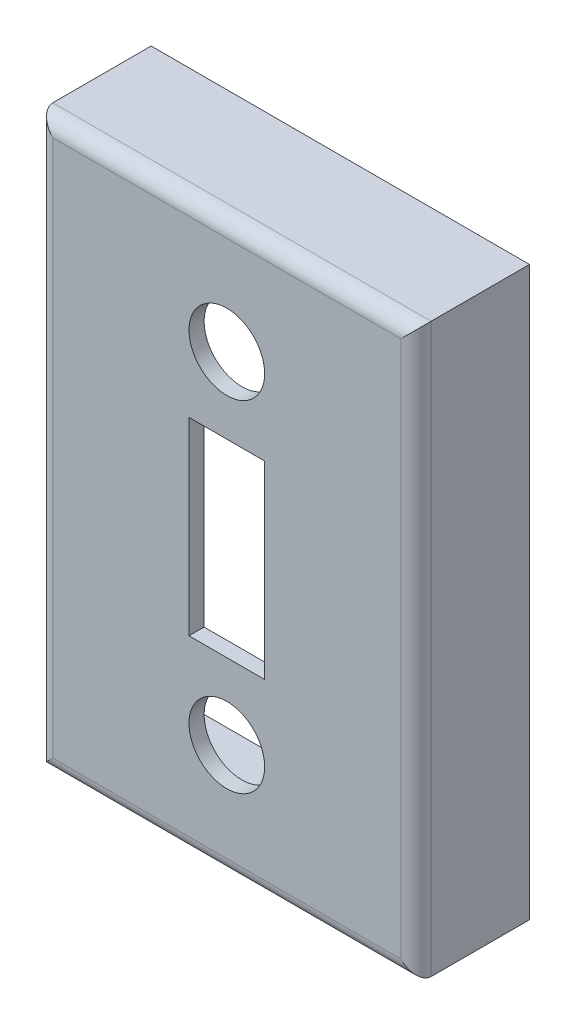
ISO-10303-21;
HEADER;
FILE_DESCRIPTION(('STEP AP214'),'2;1');
FILE_NAME('part.step','',(''),(''),'','','');
FILE_SCHEMA(('AUTOMOTIVE_DESIGN { 1 0 10303 214 1 1 1 1 }'));
ENDSEC;
DATA;
#1=APPLICATION_CONTEXT('core data for automotive mechanical design processes');
#2=APPLICATION_PROTOCOL_DEFINITION('international standard','automotive_design',2000,#1);
#3=PRODUCT_CONTEXT('',#1,'mechanical');
#4=PRODUCT('Part','Part','',(#3));
#5=PRODUCT_RELATED_PRODUCT_CATEGORY('part','',(#4));
#6=PRODUCT_DEFINITION_FORMATION('','',#4);
#7=PRODUCT_DEFINITION_CONTEXT('part definition',#1,'design');
#8=PRODUCT_DEFINITION('design','',#6,#7);
#9=PRODUCT_DEFINITION_SHAPE('','',#8);
#10=(LENGTH_UNIT() NAMED_UNIT(*) SI_UNIT(.MILLI.,.METRE.));
#11=(NAMED_UNIT(*) PLANE_ANGLE_UNIT() SI_UNIT($,.RADIAN.));
#12=(NAMED_UNIT(*) SI_UNIT($,.STERADIAN.) SOLID_ANGLE_UNIT());
#13=UNCERTAINTY_MEASURE_WITH_UNIT(LENGTH_MEASURE(1.E-05),#10,'distance_accuracy_value','');
#14=(GEOMETRIC_REPRESENTATION_CONTEXT(3) GLOBAL_UNCERTAINTY_ASSIGNED_CONTEXT((#13)) GLOBAL_UNIT_ASSIGNED_CONTEXT((#10,
#11,#12)) REPRESENTATION_CONTEXT('',''));
#15=CARTESIAN_POINT('',(0.,0.,0.));
#16=DIRECTION('',(0.,0.,1.));
#17=DIRECTION('',(1.,0.,0.));
#18=AXIS2_PLACEMENT_3D('',#15,#16,#17);
#19=CARTESIAN_POINT('',(0.,0.,0.));
#20=DIRECTION('',(0.,0.,-1.));
#21=DIRECTION('',(-1.,0.,0.));
#22=AXIS2_PLACEMENT_3D('',#19,#20,#21);
#23=PLANE('',#22);
#24=DIRECTION('',(0.,-1.,0.));
#25=VECTOR('',#24,1.);
#26=CARTESIAN_POINT('',(0.,0.,0.));
#27=LINE('',#26,#25);
#28=CARTESIAN_POINT('',(0.,75.,0.));
#29=VERTEX_POINT('',#28);
#30=CARTESIAN_POINT('',(0.,0.,0.));
#31=VERTEX_POINT('',#30);
#32=EDGE_CURVE('E167',#29,#31,#27,.T.);
#33=ORIENTED_EDGE('',*,*,#32,.F.);
#34=DIRECTION('',(-1.,0.,0.));
#35=VECTOR('',#34,1.);
#36=CARTESIAN_POINT('',(0.,75.,0.));
#37=LINE('',#36,#35);
#38=CARTESIAN_POINT('',(50.,75.,0.));
#39=VERTEX_POINT('',#38);
#40=EDGE_CURVE('E205',#39,#29,#37,.T.);
#41=ORIENTED_EDGE('',*,*,#40,.F.);
#42=DIRECTION('',(0.,1.,0.));
#43=VECTOR('',#42,1.);
#44=CARTESIAN_POINT('',(50.,0.,0.));
#45=LINE('',#44,#43);
#46=CARTESIAN_POINT('',(50.,0.,0.));
#47=VERTEX_POINT('',#46);
#48=EDGE_CURVE('E202',#47,#39,#45,.T.);
#49=ORIENTED_EDGE('',*,*,#48,.F.);
#50=DIRECTION('',(1.,0.,0.));
#51=VECTOR('',#50,1.);
#52=CARTESIAN_POINT('',(0.,0.,0.));
#53=LINE('',#52,#51);
#54=EDGE_CURVE('E199',#31,#47,#53,.T.);
#55=ORIENTED_EDGE('',*,*,#54,.F.);
#56=EDGE_LOOP('',(#33,#41,#49,#55));
#57=FACE_BOUND('',#56,.T.);
#58=DIRECTION('',(-1.,0.,0.));
#59=VECTOR('',#58,1.);
#60=CARTESIAN_POINT('',(0.,73.,0.));
#61=LINE('',#60,#59);
#62=CARTESIAN_POINT('',(48.,73.,0.));
#63=VERTEX_POINT('',#62);
#64=CARTESIAN_POINT('',(1.99999999999999,73.,0.));
#65=VERTEX_POINT('',#64);
#66=EDGE_CURVE('E173',#63,#65,#61,.T.);
#67=ORIENTED_EDGE('',*,*,#66,.T.);
#68=DIRECTION('',(0.,-1.,0.));
#69=VECTOR('',#68,1.);
#70=CARTESIAN_POINT('',(2.,0.,0.));
#71=LINE('',#70,#69);
#72=CARTESIAN_POINT('',(2.,2.,0.));
#73=VERTEX_POINT('',#72);
#74=EDGE_CURVE('E185',#65,#73,#71,.T.);
#75=ORIENTED_EDGE('',*,*,#74,.T.);
#76=DIRECTION('',(1.,0.,0.));
#77=VECTOR('',#76,1.);
#78=CARTESIAN_POINT('',(0.,2.,0.));
#79=LINE('',#78,#77);
#80=CARTESIAN_POINT('',(48.,2.,0.));
#81=VERTEX_POINT('',#80);
#82=EDGE_CURVE('E188',#73,#81,#79,.T.);
#83=ORIENTED_EDGE('',*,*,#82,.T.);
#84=DIRECTION('',(0.,1.,0.));
#85=VECTOR('',#84,1.);
#86=CARTESIAN_POINT('',(48.,0.,0.));
#87=LINE('',#86,#85);
#88=EDGE_CURVE('E192',#81,#63,#87,.T.);
#89=ORIENTED_EDGE('',*,*,#88,.T.);
#90=EDGE_LOOP('',(#67,#75,#83,#89));
#91=FACE_BOUND('',#90,.T.);
#92=ADVANCED_FACE('F33',(#57,#91),#23,.T.);
#93=CARTESIAN_POINT('',(0.,0.,15.));
#94=DIRECTION('',(1.,0.,0.));
#95=DIRECTION('',(0.,1.,0.));
#96=AXIS2_PLACEMENT_3D('',#93,#94,#95);
#97=PLANE('',#96);
#98=DIRECTION('',(0.,0.,-1.));
#99=VECTOR('',#98,1.);
#100=CARTESIAN_POINT('',(0.,0.,15.));
#101=LINE('',#100,#99);
#102=CARTESIAN_POINT('',(0.,0.,13.));
#103=VERTEX_POINT('',#102);
#104=EDGE_CURVE('E214',#103,#31,#101,.T.);
#105=ORIENTED_EDGE('',*,*,#104,.F.);
#106=DIRECTION('',(0.,-1.,0.));
#107=VECTOR('',#106,1.);
#108=CARTESIAN_POINT('',(0.,0.,13.));
#109=LINE('',#108,#107);
#110=CARTESIAN_POINT('',(0.,75.,13.));
#111=VERTEX_POINT('',#110);
#112=EDGE_CURVE('E225',#103,#111,#109,.F.);
#113=ORIENTED_EDGE('',*,*,#112,.T.);
#114=DIRECTION('',(0.,0.,-1.));
#115=VECTOR('',#114,1.);
#116=CARTESIAN_POINT('',(0.,75.,15.));
#117=LINE('',#116,#115);
#118=EDGE_CURVE('E208',#111,#29,#117,.T.);
#119=ORIENTED_EDGE('',*,*,#118,.T.);
#120=ORIENTED_EDGE('',*,*,#32,.T.);
#121=EDGE_LOOP('',(#105,#113,#119,#120));
#122=FACE_BOUND('',#121,.T.);
#123=ADVANCED_FACE('F280',(#122),#97,.F.);
#124=CARTESIAN_POINT('',(0.,0.,15.));
#125=DIRECTION('',(0.,1.,0.));
#126=DIRECTION('',(0.,0.,1.));
#127=AXIS2_PLACEMENT_3D('',#124,#125,#126);
#128=PLANE('',#127);
#129=DIRECTION('',(0.,0.,-1.));
#130=VECTOR('',#129,1.);
#131=CARTESIAN_POINT('',(50.,0.,15.));
#132=LINE('',#131,#130);
#133=CARTESIAN_POINT('',(50.,0.,13.));
#134=VERTEX_POINT('',#133);
#135=EDGE_CURVE('E212',#134,#47,#132,.T.);
#136=ORIENTED_EDGE('',*,*,#135,.F.);
#137=DIRECTION('',(1.,0.,0.));
#138=VECTOR('',#137,1.);
#139=CARTESIAN_POINT('',(0.,0.,13.));
#140=LINE('',#139,#138);
#141=EDGE_CURVE('E228',#134,#103,#140,.F.);
#142=ORIENTED_EDGE('',*,*,#141,.T.);
#143=ORIENTED_EDGE('',*,*,#104,.T.);
#144=ORIENTED_EDGE('',*,*,#54,.T.);
#145=EDGE_LOOP('',(#136,#142,#143,#144));
#146=FACE_BOUND('',#145,.T.);
#147=ADVANCED_FACE('F285',(#146),#128,.F.);
#148=CARTESIAN_POINT('',(50.,0.,15.));
#149=DIRECTION('',(-1.,0.,0.));
#150=DIRECTION('',(0.,-1.,0.));
#151=AXIS2_PLACEMENT_3D('',#148,#149,#150);
#152=PLANE('',#151);
#153=DIRECTION('',(0.,0.,-1.));
#154=VECTOR('',#153,1.);
#155=CARTESIAN_POINT('',(50.,75.,15.));
#156=LINE('',#155,#154);
#157=CARTESIAN_POINT('',(50.,75.,13.));
#158=VERTEX_POINT('',#157);
#159=EDGE_CURVE('E210',#158,#39,#156,.T.);
#160=ORIENTED_EDGE('',*,*,#159,.F.);
#161=DIRECTION('',(0.,1.,0.));
#162=VECTOR('',#161,1.);
#163=CARTESIAN_POINT('',(50.,0.,13.));
#164=LINE('',#163,#162);
#165=EDGE_CURVE('E230',#158,#134,#164,.F.);
#166=ORIENTED_EDGE('',*,*,#165,.T.);
#167=ORIENTED_EDGE('',*,*,#135,.T.);
#168=ORIENTED_EDGE('',*,*,#48,.T.);
#169=EDGE_LOOP('',(#160,#166,#167,#168));
#170=FACE_BOUND('',#169,.T.);
#171=ADVANCED_FACE('F274',(#170),#152,.F.);
#172=CARTESIAN_POINT('',(0.,75.,15.));
#173=DIRECTION('',(0.,-1.,0.));
#174=DIRECTION('',(0.,0.,-1.));
#175=AXIS2_PLACEMENT_3D('',#172,#173,#174);
#176=PLANE('',#175);
#177=ORIENTED_EDGE('',*,*,#118,.F.);
#178=DIRECTION('',(-1.,0.,0.));
#179=VECTOR('',#178,1.);
#180=CARTESIAN_POINT('',(0.,75.,13.));
#181=LINE('',#180,#179);
#182=EDGE_CURVE('E232',#111,#158,#181,.F.);
#183=ORIENTED_EDGE('',*,*,#182,.T.);
#184=ORIENTED_EDGE('',*,*,#159,.T.);
#185=ORIENTED_EDGE('',*,*,#40,.T.);
#186=EDGE_LOOP('',(#177,#183,#184,#185));
#187=FACE_BOUND('',#186,.T.);
#188=ADVANCED_FACE('F264',(#187),#176,.F.);
#189=CARTESIAN_POINT('',(0.,0.,15.));
#190=DIRECTION('',(0.,0.,-1.));
#191=DIRECTION('',(-1.,0.,0.));
#192=AXIS2_PLACEMENT_3D('',#189,#190,#191);
#193=PLANE('',#192);
#194=CARTESIAN_POINT('',(25.,60.,15.));
#195=DIRECTION('',(0.,0.,1.));
#196=DIRECTION('',(1.,0.,0.));
#197=AXIS2_PLACEMENT_3D('',#194,#195,#196);
#198=CIRCLE('',#197,5.);
#199=CARTESIAN_POINT('',(30.,60.,15.));
#200=VERTEX_POINT('',#199);
#201=EDGE_CURVE('E247',#200,#200,#198,.T.);
#202=ORIENTED_EDGE('',*,*,#201,.F.);
#203=EDGE_LOOP('',(#202));
#204=FACE_BOUND('',#203,.T.);
#205=CARTESIAN_POINT('',(25.,15.,15.));
#206=DIRECTION('',(0.,0.,1.));
#207=DIRECTION('',(1.,0.,0.));
#208=AXIS2_PLACEMENT_3D('',#205,#206,#207);
#209=CIRCLE('',#208,5.);
#210=CARTESIAN_POINT('',(30.,15.,15.));
#211=VERTEX_POINT('',#210);
#212=EDGE_CURVE('E252',#211,#211,#209,.T.);
#213=ORIENTED_EDGE('',*,*,#212,.F.);
#214=EDGE_LOOP('',(#213));
#215=FACE_BOUND('',#214,.T.);
#216=DIRECTION('',(1.,0.,0.));
#217=VECTOR('',#216,1.);
#218=CARTESIAN_POINT('',(20.,25.,15.));
#219=LINE('',#218,#217);
#220=CARTESIAN_POINT('',(20.,25.,15.));
#221=VERTEX_POINT('',#220);
#222=CARTESIAN_POINT('',(30.,25.,15.));
#223=VERTEX_POINT('',#222);
#224=EDGE_CURVE('E147',#221,#223,#219,.T.);
#225=ORIENTED_EDGE('',*,*,#224,.F.);
#226=DIRECTION('',(0.,-1.,0.));
#227=VECTOR('',#226,1.);
#228=CARTESIAN_POINT('',(20.,50.,15.));
#229=LINE('',#228,#227);
#230=CARTESIAN_POINT('',(20.,50.,15.));
#231=VERTEX_POINT('',#230);
#232=EDGE_CURVE('E50',#231,#221,#229,.T.);
#233=ORIENTED_EDGE('',*,*,#232,.F.);
#234=DIRECTION('',(-1.,0.,0.));
#235=VECTOR('',#234,1.);
#236=CARTESIAN_POINT('',(20.,50.,15.));
#237=LINE('',#236,#235);
#238=CARTESIAN_POINT('',(30.,50.,15.));
#239=VERTEX_POINT('',#238);
#240=EDGE_CURVE('E154',#239,#231,#237,.T.);
#241=ORIENTED_EDGE('',*,*,#240,.F.);
#242=DIRECTION('',(0.,1.,0.));
#243=VECTOR('',#242,1.);
#244=CARTESIAN_POINT('',(30.,50.,15.));
#245=LINE('',#244,#243);
#246=EDGE_CURVE('E138',#223,#239,#245,.T.);
#247=ORIENTED_EDGE('',*,*,#246,.F.);
#248=EDGE_LOOP('',(#225,#233,#241,#247));
#249=FACE_BOUND('',#248,.T.);
#250=DIRECTION('',(-1.,0.,0.));
#251=VECTOR('',#250,1.);
#252=CARTESIAN_POINT('',(0.,73.,15.));
#253=LINE('',#252,#251);
#254=CARTESIAN_POINT('',(48.,73.,15.));
#255=VERTEX_POINT('',#254);
#256=CARTESIAN_POINT('',(1.99999999999999,73.,15.));
#257=VERTEX_POINT('',#256);
#258=EDGE_CURVE('E216',#255,#257,#253,.T.);
#259=ORIENTED_EDGE('',*,*,#258,.T.);
#260=DIRECTION('',(0.,-1.,0.));
#261=VECTOR('',#260,1.);
#262=CARTESIAN_POINT('',(2.,0.,15.));
#263=LINE('',#262,#261);
#264=CARTESIAN_POINT('',(2.,2.,15.));
#265=VERTEX_POINT('',#264);
#266=EDGE_CURVE('E222',#257,#265,#263,.T.);
#267=ORIENTED_EDGE('',*,*,#266,.T.);
#268=DIRECTION('',(1.,0.,0.));
#269=VECTOR('',#268,1.);
#270=CARTESIAN_POINT('',(0.,2.,15.));
#271=LINE('',#270,#269);
#272=CARTESIAN_POINT('',(48.,2.,15.));
#273=VERTEX_POINT('',#272);
#274=EDGE_CURVE('E220',#265,#273,#271,.T.);
#275=ORIENTED_EDGE('',*,*,#274,.T.);
#276=DIRECTION('',(0.,1.,0.));
#277=VECTOR('',#276,1.);
#278=CARTESIAN_POINT('',(48.,0.,15.));
#279=LINE('',#278,#277);
#280=EDGE_CURVE('E218',#273,#255,#279,.T.);
#281=ORIENTED_EDGE('',*,*,#280,.T.);
#282=EDGE_LOOP('',(#259,#267,#275,#281));
#283=FACE_BOUND('',#282,.T.);
#284=ADVANCED_FACE('F151',(#204,#215,#249,#283),#193,.F.);
#285=CARTESIAN_POINT('',(2.,0.,15.));
#286=DIRECTION('',(1.,0.,0.));
#287=DIRECTION('',(0.,1.,0.));
#288=AXIS2_PLACEMENT_3D('',#285,#286,#287);
#289=PLANE('',#288);
#290=ORIENTED_EDGE('',*,*,#74,.F.);
#291=DIRECTION('',(0.,0.,-1.));
#292=VECTOR('',#291,1.);
#293=CARTESIAN_POINT('',(1.99999999999999,73.,15.));
#294=LINE('',#293,#292);
#295=CARTESIAN_POINT('',(1.99999999999999,73.,13.));
#296=VERTEX_POINT('',#295);
#297=EDGE_CURVE('E174',#296,#65,#294,.T.);
#298=ORIENTED_EDGE('',*,*,#297,.F.);
#299=DIRECTION('',(0.,-1.,0.));
#300=VECTOR('',#299,1.);
#301=CARTESIAN_POINT('',(2.,0.,13.));
#302=LINE('',#301,#300);
#303=CARTESIAN_POINT('',(2.,2.,13.));
#304=VERTEX_POINT('',#303);
#305=EDGE_CURVE('E169',#296,#304,#302,.T.);
#306=ORIENTED_EDGE('',*,*,#305,.T.);
#307=DIRECTION('',(0.,0.,-1.));
#308=VECTOR('',#307,1.);
#309=CARTESIAN_POINT('',(2.,2.,15.));
#310=LINE('',#309,#308);
#311=EDGE_CURVE('E164',#304,#73,#310,.T.);
#312=ORIENTED_EDGE('',*,*,#311,.T.);
#313=EDGE_LOOP('',(#290,#298,#306,#312));
#314=FACE_BOUND('',#313,.T.);
#315=ADVANCED_FACE('F263',(#314),#289,.T.);
#316=CARTESIAN_POINT('',(0.,2.,15.));
#317=DIRECTION('',(0.,1.,0.));
#318=DIRECTION('',(0.,0.,1.));
#319=AXIS2_PLACEMENT_3D('',#316,#317,#318);
#320=PLANE('',#319);
#321=ORIENTED_EDGE('',*,*,#82,.F.);
#322=ORIENTED_EDGE('',*,*,#311,.F.);
#323=DIRECTION('',(1.,0.,0.));
#324=VECTOR('',#323,1.);
#325=CARTESIAN_POINT('',(0.,2.,13.));
#326=LINE('',#325,#324);
#327=CARTESIAN_POINT('',(48.,2.,13.));
#328=VERTEX_POINT('',#327);
#329=EDGE_CURVE('E172',#304,#328,#326,.T.);
#330=ORIENTED_EDGE('',*,*,#329,.T.);
#331=DIRECTION('',(0.,0.,-1.));
#332=VECTOR('',#331,1.);
#333=CARTESIAN_POINT('',(48.,2.,15.));
#334=LINE('',#333,#332);
#335=EDGE_CURVE('E168',#328,#81,#334,.T.);
#336=ORIENTED_EDGE('',*,*,#335,.T.);
#337=EDGE_LOOP('',(#321,#322,#330,#336));
#338=FACE_BOUND('',#337,.T.);
#339=ADVANCED_FACE('F271',(#338),#320,.T.);
#340=CARTESIAN_POINT('',(48.,0.,15.));
#341=DIRECTION('',(-1.,0.,0.));
#342=DIRECTION('',(0.,-1.,0.));
#343=AXIS2_PLACEMENT_3D('',#340,#341,#342);
#344=PLANE('',#343);
#345=ORIENTED_EDGE('',*,*,#88,.F.);
#346=ORIENTED_EDGE('',*,*,#335,.F.);
#347=DIRECTION('',(0.,1.,0.));
#348=VECTOR('',#347,1.);
#349=CARTESIAN_POINT('',(48.,0.,13.));
#350=LINE('',#349,#348);
#351=CARTESIAN_POINT('',(48.,73.,13.));
#352=VERTEX_POINT('',#351);
#353=EDGE_CURVE('E181',#328,#352,#350,.T.);
#354=ORIENTED_EDGE('',*,*,#353,.T.);
#355=DIRECTION('',(0.,0.,-1.));
#356=VECTOR('',#355,1.);
#357=CARTESIAN_POINT('',(48.,73.,15.));
#358=LINE('',#357,#356);
#359=EDGE_CURVE('E176',#352,#63,#358,.T.);
#360=ORIENTED_EDGE('',*,*,#359,.T.);
#361=EDGE_LOOP('',(#345,#346,#354,#360));
#362=FACE_BOUND('',#361,.T.);
#363=ADVANCED_FACE('F340',(#362),#344,.T.);
#364=CARTESIAN_POINT('',(0.,73.,15.));
#365=DIRECTION('',(0.,-1.,0.));
#366=DIRECTION('',(0.,0.,-1.));
#367=AXIS2_PLACEMENT_3D('',#364,#365,#366);
#368=PLANE('',#367);
#369=ORIENTED_EDGE('',*,*,#66,.F.);
#370=ORIENTED_EDGE('',*,*,#359,.F.);
#371=DIRECTION('',(-1.,0.,0.));
#372=VECTOR('',#371,1.);
#373=CARTESIAN_POINT('',(0.,73.,13.));
#374=LINE('',#373,#372);
#375=EDGE_CURVE('E177',#352,#296,#374,.T.);
#376=ORIENTED_EDGE('',*,*,#375,.T.);
#377=ORIENTED_EDGE('',*,*,#297,.T.);
#378=EDGE_LOOP('',(#369,#370,#376,#377));
#379=FACE_BOUND('',#378,.T.);
#380=ADVANCED_FACE('F335',(#379),#368,.T.);
#381=CARTESIAN_POINT('',(0.,0.,13.));
#382=DIRECTION('',(0.,0.,-1.));
#383=DIRECTION('',(-1.,0.,0.));
#384=AXIS2_PLACEMENT_3D('',#381,#382,#383);
#385=PLANE('',#384);
#386=CARTESIAN_POINT('',(25.,60.,13.));
#387=DIRECTION('',(0.,0.,-1.));
#388=DIRECTION('',(-1.,0.,0.));
#389=AXIS2_PLACEMENT_3D('',#386,#387,#388);
#390=CIRCLE('',#389,5.);
#391=CARTESIAN_POINT('',(20.,60.,13.));
#392=VERTEX_POINT('',#391);
#393=EDGE_CURVE('E37',#392,#392,#390,.T.);
#394=ORIENTED_EDGE('',*,*,#393,.F.);
#395=EDGE_LOOP('',(#394));
#396=FACE_BOUND('',#395,.T.);
#397=CARTESIAN_POINT('',(25.,15.,13.));
#398=DIRECTION('',(0.,0.,-1.));
#399=DIRECTION('',(-1.,0.,0.));
#400=AXIS2_PLACEMENT_3D('',#397,#398,#399);
#401=CIRCLE('',#400,5.);
#402=CARTESIAN_POINT('',(20.,15.,13.));
#403=VERTEX_POINT('',#402);
#404=EDGE_CURVE('E245',#403,#403,#401,.T.);
#405=ORIENTED_EDGE('',*,*,#404,.F.);
#406=EDGE_LOOP('',(#405));
#407=FACE_BOUND('',#406,.T.);
#408=DIRECTION('',(0.,1.,0.));
#409=VECTOR('',#408,1.);
#410=CARTESIAN_POINT('',(20.,0.,13.));
#411=LINE('',#410,#409);
#412=CARTESIAN_POINT('',(20.,25.,13.));
#413=VERTEX_POINT('',#412);
#414=CARTESIAN_POINT('',(20.,50.,13.));
#415=VERTEX_POINT('',#414);
#416=EDGE_CURVE('E11',#413,#415,#411,.T.);
#417=ORIENTED_EDGE('',*,*,#416,.F.);
#418=DIRECTION('',(-1.,0.,0.));
#419=VECTOR('',#418,1.);
#420=CARTESIAN_POINT('',(0.,25.,13.));
#421=LINE('',#420,#419);
#422=CARTESIAN_POINT('',(30.,25.,13.));
#423=VERTEX_POINT('',#422);
#424=EDGE_CURVE('E234',#423,#413,#421,.T.);
#425=ORIENTED_EDGE('',*,*,#424,.F.);
#426=DIRECTION('',(0.,-1.,0.));
#427=VECTOR('',#426,1.);
#428=CARTESIAN_POINT('',(30.,0.,13.));
#429=LINE('',#428,#427);
#430=CARTESIAN_POINT('',(30.,50.,13.));
#431=VERTEX_POINT('',#430);
#432=EDGE_CURVE('E141',#431,#423,#429,.T.);
#433=ORIENTED_EDGE('',*,*,#432,.F.);
#434=DIRECTION('',(1.,0.,0.));
#435=VECTOR('',#434,1.);
#436=CARTESIAN_POINT('',(0.,50.,13.));
#437=LINE('',#436,#435);
#438=EDGE_CURVE('E42',#415,#431,#437,.T.);
#439=ORIENTED_EDGE('',*,*,#438,.F.);
#440=EDGE_LOOP('',(#417,#425,#433,#439));
#441=FACE_BOUND('',#440,.T.);
#442=ORIENTED_EDGE('',*,*,#305,.F.);
#443=ORIENTED_EDGE('',*,*,#375,.F.);
#444=ORIENTED_EDGE('',*,*,#353,.F.);
#445=ORIENTED_EDGE('',*,*,#329,.F.);
#446=EDGE_LOOP('',(#442,#443,#444,#445));
#447=FACE_BOUND('',#446,.T.);
#448=ADVANCED_FACE('F311',(#396,#407,#441,#447),#385,.T.);
#449=CARTESIAN_POINT('',(48.,0.,13.));
#450=DIRECTION('',(0.,1.,0.));
#451=DIRECTION('',(-1.,0.,0.));
#452=AXIS2_PLACEMENT_3D('',#449,#450,#451);
#453=CYLINDRICAL_SURFACE('',#452,2.);
#454=CARTESIAN_POINT('',(48.,2.,13.));
#455=DIRECTION('',(0.707106781186547,0.707106781186548,0.));
#456=DIRECTION('',(-0.707106781186548,0.707106781186547,0.));
#457=AXIS2_PLACEMENT_3D('',#454,#455,#456);
#458=ELLIPSE('',#457,2.82842712474619,2.);
#459=EDGE_CURVE('E238',#134,#273,#458,.F.);
#460=ORIENTED_EDGE('',*,*,#459,.F.);
#461=ORIENTED_EDGE('',*,*,#165,.F.);
#462=CARTESIAN_POINT('',(48.,73.,13.));
#463=DIRECTION('',(-0.707106781186548,0.707106781186547,0.));
#464=DIRECTION('',(-0.707106781186547,-0.707106781186548,0.));
#465=AXIS2_PLACEMENT_3D('',#462,#463,#464);
#466=ELLIPSE('',#465,2.82842712474619,2.);
#467=EDGE_CURVE('E189',#255,#158,#466,.T.);
#468=ORIENTED_EDGE('',*,*,#467,.F.);
#469=ORIENTED_EDGE('',*,*,#280,.F.);
#470=EDGE_LOOP('',(#460,#461,#468,#469));
#471=FACE_BOUND('',#470,.T.);
#472=ADVANCED_FACE('F35',(#471),#453,.T.);
#473=CARTESIAN_POINT('',(0.,73.,13.));
#474=DIRECTION('',(-1.,0.,0.));
#475=DIRECTION('',(0.,0.,1.));
#476=AXIS2_PLACEMENT_3D('',#473,#474,#475);
#477=CYLINDRICAL_SURFACE('',#476,2.);
#478=ORIENTED_EDGE('',*,*,#467,.T.);
#479=ORIENTED_EDGE('',*,*,#182,.F.);
#480=CARTESIAN_POINT('',(1.99999999999999,73.,13.));
#481=DIRECTION('',(-0.707106781186547,-0.707106781186548,0.));
#482=DIRECTION('',(-0.707106781186548,0.707106781186547,0.));
#483=AXIS2_PLACEMENT_3D('',#480,#481,#482);
#484=ELLIPSE('',#483,2.82842712474619,2.);
#485=EDGE_CURVE('E236',#257,#111,#484,.T.);
#486=ORIENTED_EDGE('',*,*,#485,.F.);
#487=ORIENTED_EDGE('',*,*,#258,.F.);
#488=EDGE_LOOP('',(#478,#479,#486,#487));
#489=FACE_BOUND('',#488,.T.);
#490=ADVANCED_FACE('F304',(#489),#477,.T.);
#491=CARTESIAN_POINT('',(0.,2.,13.));
#492=DIRECTION('',(1.,0.,0.));
#493=DIRECTION('',(0.,0.,-1.));
#494=AXIS2_PLACEMENT_3D('',#491,#492,#493);
#495=CYLINDRICAL_SURFACE('',#494,2.);
#496=ORIENTED_EDGE('',*,*,#459,.T.);
#497=ORIENTED_EDGE('',*,*,#274,.F.);
#498=CARTESIAN_POINT('',(2.,2.,13.));
#499=DIRECTION('',(0.707106781186548,-0.707106781186547,0.));
#500=DIRECTION('',(0.707106781186547,0.707106781186548,0.));
#501=AXIS2_PLACEMENT_3D('',#498,#499,#500);
#502=ELLIPSE('',#501,2.82842712474619,2.);
#503=EDGE_CURVE('E161',#103,#265,#502,.F.);
#504=ORIENTED_EDGE('',*,*,#503,.F.);
#505=ORIENTED_EDGE('',*,*,#141,.F.);
#506=EDGE_LOOP('',(#496,#497,#504,#505));
#507=FACE_BOUND('',#506,.T.);
#508=ADVANCED_FACE('F301',(#507),#495,.T.);
#509=CARTESIAN_POINT('',(2.,0.,13.));
#510=DIRECTION('',(0.,-1.,0.));
#511=DIRECTION('',(1.,0.,0.));
#512=AXIS2_PLACEMENT_3D('',#509,#510,#511);
#513=CYLINDRICAL_SURFACE('',#512,2.);
#514=ORIENTED_EDGE('',*,*,#485,.T.);
#515=ORIENTED_EDGE('',*,*,#112,.F.);
#516=ORIENTED_EDGE('',*,*,#503,.T.);
#517=ORIENTED_EDGE('',*,*,#266,.F.);
#518=EDGE_LOOP('',(#514,#515,#516,#517));
#519=FACE_BOUND('',#518,.T.);
#520=ADVANCED_FACE('F297',(#519),#513,.T.);
#521=CARTESIAN_POINT('',(20.,50.,0.));
#522=DIRECTION('',(-1.,0.,0.));
#523=DIRECTION('',(0.,-1.,0.));
#524=AXIS2_PLACEMENT_3D('',#521,#522,#523);
#525=PLANE('',#524);
#526=ORIENTED_EDGE('',*,*,#416,.T.);
#527=DIRECTION('',(0.,0.,1.));
#528=VECTOR('',#527,1.);
#529=CARTESIAN_POINT('',(20.,50.,0.));
#530=LINE('',#529,#528);
#531=EDGE_CURVE('E159',#415,#231,#530,.T.);
#532=ORIENTED_EDGE('',*,*,#531,.T.);
#533=ORIENTED_EDGE('',*,*,#232,.T.);
#534=DIRECTION('',(0.,0.,1.));
#535=VECTOR('',#534,1.);
#536=CARTESIAN_POINT('',(20.,25.,0.));
#537=LINE('',#536,#535);
#538=EDGE_CURVE('E144',#413,#221,#537,.T.);
#539=ORIENTED_EDGE('',*,*,#538,.F.);
#540=EDGE_LOOP('',(#526,#532,#533,#539));
#541=FACE_BOUND('',#540,.T.);
#542=ADVANCED_FACE('F300',(#541),#525,.F.);
#543=CARTESIAN_POINT('',(20.,50.,0.));
#544=DIRECTION('',(0.,1.,0.));
#545=DIRECTION('',(0.,0.,1.));
#546=AXIS2_PLACEMENT_3D('',#543,#544,#545);
#547=PLANE('',#546);
#548=ORIENTED_EDGE('',*,*,#438,.T.);
#549=DIRECTION('',(0.,0.,1.));
#550=VECTOR('',#549,1.);
#551=CARTESIAN_POINT('',(30.,50.,0.));
#552=LINE('',#551,#550);
#553=EDGE_CURVE('E143',#431,#239,#552,.T.);
#554=ORIENTED_EDGE('',*,*,#553,.T.);
#555=ORIENTED_EDGE('',*,*,#240,.T.);
#556=ORIENTED_EDGE('',*,*,#531,.F.);
#557=EDGE_LOOP('',(#548,#554,#555,#556));
#558=FACE_BOUND('',#557,.T.);
#559=ADVANCED_FACE('F354',(#558),#547,.F.);
#560=CARTESIAN_POINT('',(30.,50.,0.));
#561=DIRECTION('',(1.,0.,0.));
#562=DIRECTION('',(0.,1.,0.));
#563=AXIS2_PLACEMENT_3D('',#560,#561,#562);
#564=PLANE('',#563);
#565=ORIENTED_EDGE('',*,*,#432,.T.);
#566=DIRECTION('',(0.,0.,1.));
#567=VECTOR('',#566,1.);
#568=CARTESIAN_POINT('',(30.,25.,0.));
#569=LINE('',#568,#567);
#570=EDGE_CURVE('E58',#423,#223,#569,.T.);
#571=ORIENTED_EDGE('',*,*,#570,.T.);
#572=ORIENTED_EDGE('',*,*,#246,.T.);
#573=ORIENTED_EDGE('',*,*,#553,.F.);
#574=EDGE_LOOP('',(#565,#571,#572,#573));
#575=FACE_BOUND('',#574,.T.);
#576=ADVANCED_FACE('F135',(#575),#564,.F.);
#577=CARTESIAN_POINT('',(20.,25.,0.));
#578=DIRECTION('',(0.,-1.,0.));
#579=DIRECTION('',(0.,0.,-1.));
#580=AXIS2_PLACEMENT_3D('',#577,#578,#579);
#581=PLANE('',#580);
#582=ORIENTED_EDGE('',*,*,#424,.T.);
#583=ORIENTED_EDGE('',*,*,#538,.T.);
#584=ORIENTED_EDGE('',*,*,#224,.T.);
#585=ORIENTED_EDGE('',*,*,#570,.F.);
#586=EDGE_LOOP('',(#582,#583,#584,#585));
#587=FACE_BOUND('',#586,.T.);
#588=ADVANCED_FACE('F148',(#587),#581,.F.);
#589=CARTESIAN_POINT('',(25.,15.,0.));
#590=DIRECTION('',(0.,0.,1.));
#591=DIRECTION('',(1.,0.,0.));
#592=AXIS2_PLACEMENT_3D('',#589,#590,#591);
#593=CYLINDRICAL_SURFACE('',#592,5.);
#594=ORIENTED_EDGE('',*,*,#404,.T.);
#595=EDGE_LOOP('',(#594));
#596=FACE_BOUND('',#595,.T.);
#597=ORIENTED_EDGE('',*,*,#212,.T.);
#598=EDGE_LOOP('',(#597));
#599=FACE_BOUND('',#598,.T.);
#600=ADVANCED_FACE('F260',(#596,#599),#593,.F.);
#601=CARTESIAN_POINT('',(25.,60.,0.));
#602=DIRECTION('',(0.,0.,1.));
#603=DIRECTION('',(1.,0.,0.));
#604=AXIS2_PLACEMENT_3D('',#601,#602,#603);
#605=CYLINDRICAL_SURFACE('',#604,5.);
#606=ORIENTED_EDGE('',*,*,#393,.T.);
#607=EDGE_LOOP('',(#606));
#608=FACE_BOUND('',#607,.T.);
#609=ORIENTED_EDGE('',*,*,#201,.T.);
#610=EDGE_LOOP('',(#609));
#611=FACE_BOUND('',#610,.T.);
#612=ADVANCED_FACE('F364',(#608,#611),#605,.F.);
#613=CLOSED_SHELL('',(#92,#123,#147,#171,#188,#284,#315,#339,#363,#380,#448,#472,#490,#508,#520,
#542,#559,#576,#588,#600,#612));
#614=MANIFOLD_SOLID_BREP('B2',#613);
#615=ADVANCED_BREP_SHAPE_REPRESENTATION('',(#18,#614),#14);
#616=SHAPE_DEFINITION_REPRESENTATION(#9,#615);
ENDSEC;
END-ISO-10303-21;
